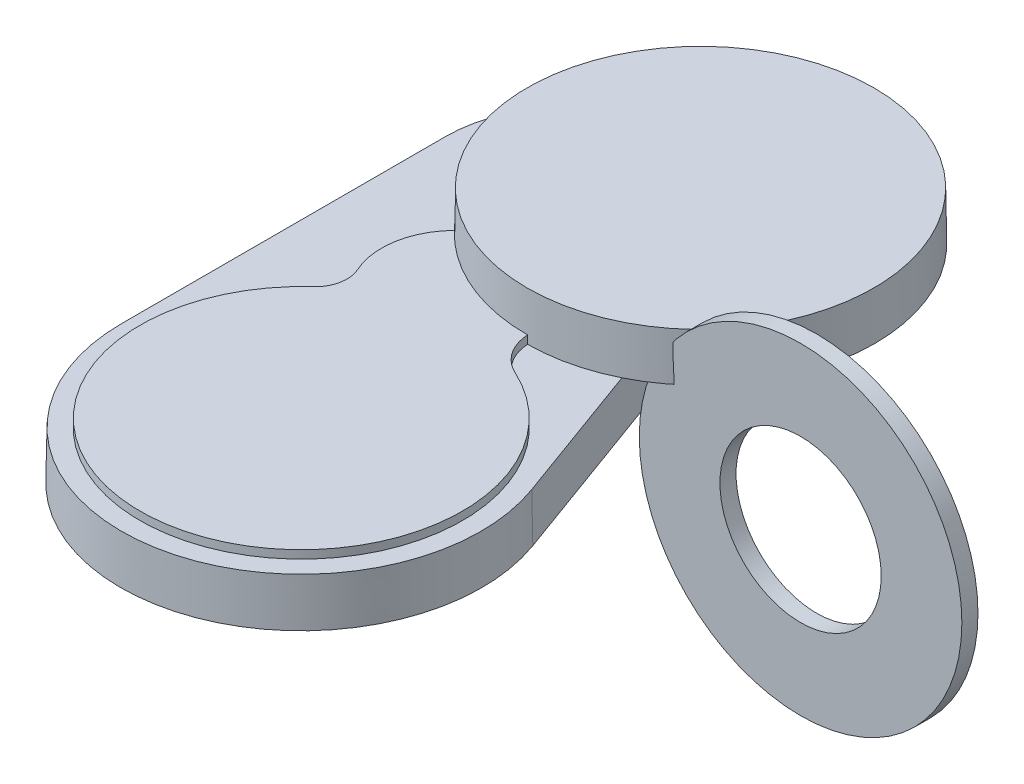
ISO-10303-21;
HEADER;
FILE_DESCRIPTION(('STEP AP214'),'2;1');
FILE_NAME('part.step','',(''),(''),'','','');
FILE_SCHEMA(('AUTOMOTIVE_DESIGN { 1 0 10303 214 1 1 1 1 }'));
ENDSEC;
DATA;
#1=APPLICATION_CONTEXT('core data for automotive mechanical design processes');
#2=APPLICATION_PROTOCOL_DEFINITION('international standard','automotive_design',2000,#1);
#3=PRODUCT_CONTEXT('',#1,'mechanical');
#4=PRODUCT('Part','Part','',(#3));
#5=PRODUCT_RELATED_PRODUCT_CATEGORY('part','',(#4));
#6=PRODUCT_DEFINITION_FORMATION('','',#4);
#7=PRODUCT_DEFINITION_CONTEXT('part definition',#1,'design');
#8=PRODUCT_DEFINITION('design','',#6,#7);
#9=PRODUCT_DEFINITION_SHAPE('','',#8);
#10=(LENGTH_UNIT() NAMED_UNIT(*) SI_UNIT(.MILLI.,.METRE.));
#11=(NAMED_UNIT(*) PLANE_ANGLE_UNIT() SI_UNIT($,.RADIAN.));
#12=(NAMED_UNIT(*) SI_UNIT($,.STERADIAN.) SOLID_ANGLE_UNIT());
#13=UNCERTAINTY_MEASURE_WITH_UNIT(LENGTH_MEASURE(1.E-05),#10,'distance_accuracy_value','');
#14=(GEOMETRIC_REPRESENTATION_CONTEXT(3) GLOBAL_UNCERTAINTY_ASSIGNED_CONTEXT((#13)) GLOBAL_UNIT_ASSIGNED_CONTEXT((#10,
#11,#12)) REPRESENTATION_CONTEXT('',''));
#15=CARTESIAN_POINT('',(0.,0.,0.));
#16=DIRECTION('',(0.,0.,1.));
#17=DIRECTION('',(1.,0.,0.));
#18=AXIS2_PLACEMENT_3D('',#15,#16,#17);
#19=CARTESIAN_POINT('',(-4.04016025250198,15.,-29.7267069339021));
#20=DIRECTION('',(0.,1.,0.));
#21=DIRECTION('',(0.,0.,1.));
#22=AXIS2_PLACEMENT_3D('',#19,#20,#21);
#23=PLANE('',#22);
#24=CARTESIAN_POINT('',(9.67975699595058E-13,15.,-1.59594559789866E-13));
#25=DIRECTION('',(0.,-1.,0.));
#26=DIRECTION('',(0.,0.,-1.));
#27=AXIS2_PLACEMENT_3D('',#24,#25,#26);
#28=CIRCLE('',#27,54.0083349609376);
#29=CARTESIAN_POINT('',(24.0192409310956,15.,48.3733016275182));
#30=VERTEX_POINT('',#29);
#31=CARTESIAN_POINT('',(0.416850091797526,15.,54.0067262593632));
#32=VERTEX_POINT('',#31);
#33=EDGE_CURVE('E155',#30,#32,#28,.T.);
#34=ORIENTED_EDGE('',*,*,#33,.T.);
#35=CARTESIAN_POINT('',(14.3966905600741,15.,53.2556866588508));
#36=DIRECTION('',(0.,-1.,0.));
#37=DIRECTION('',(0.,0.,-1.));
#38=AXIS2_PLACEMENT_3D('',#35,#36,#37);
#39=CIRCLE('',#38,14.);
#40=CARTESIAN_POINT('',(8.5440911187499,15.,65.9736691945917));
#41=VERTEX_POINT('',#40);
#42=EDGE_CURVE('E292',#41,#32,#39,.T.);
#43=ORIENTED_EDGE('',*,*,#42,.F.);
#44=CARTESIAN_POINT('',(-12.3580497431221,15.,111.395035393667));
#45=DIRECTION('',(0.,1.,0.));
#46=DIRECTION('',(0.,0.,1.));
#47=AXIS2_PLACEMENT_3D('',#44,#45,#46);
#48=CIRCLE('',#47,50.);
#49=CARTESIAN_POINT('',(-45.934725953299,15.,74.3463267160766));
#50=VERTEX_POINT('',#49);
#51=EDGE_CURVE('E282',#50,#41,#48,.T.);
#52=ORIENTED_EDGE('',*,*,#51,.F.);
#53=CARTESIAN_POINT('',(-52.6500611953344,15.,66.9365849805586));
#54=DIRECTION('',(0.,-1.,0.));
#55=DIRECTION('',(0.,0.,1.));
#56=AXIS2_PLACEMENT_3D('',#53,#54,#55);
#57=CIRCLE('',#56,10.);
#58=CARTESIAN_POINT('',(-43.5449796893151,15.,62.8016737640094));
#59=VERTEX_POINT('',#58);
#60=EDGE_CURVE('E288',#59,#50,#57,.T.);
#61=ORIENTED_EDGE('',*,*,#60,.F.);
#62=CARTESIAN_POINT('',(-22.6032922254706,15.,53.2913779659463));
#63=DIRECTION('',(0.,1.,0.));
#64=DIRECTION('',(0.,0.,1.));
#65=AXIS2_PLACEMENT_3D('',#62,#63,#64);
#66=CIRCLE('',#65,23.);
#67=CARTESIAN_POINT('',(-39.0963987597677,15.,37.2608621648773));
#68=VERTEX_POINT('',#67);
#69=EDGE_CURVE('E290',#68,#59,#66,.T.);
#70=ORIENTED_EDGE('',*,*,#69,.F.);
#71=CARTESIAN_POINT('',(-49.4166384036446,15.,-21.7921108233274));
#72=VERTEX_POINT('',#71);
#73=EDGE_CURVE('E152',#68,#72,#28,.T.);
#74=ORIENTED_EDGE('',*,*,#73,.T.);
#75=CARTESIAN_POINT('',(-30.070163865149,15.,10.9446445864215));
#76=DIRECTION('',(0.,1.,0.));
#77=DIRECTION('',(0.,0.,1.));
#78=AXIS2_PLACEMENT_3D('',#75,#76,#77);
#79=CIRCLE('',#78,38.0260599040497);
#80=CARTESIAN_POINT('',(-68.0962237691988,15.,10.9446445864215));
#81=VERTEX_POINT('',#80);
#82=EDGE_CURVE('E220',#72,#81,#79,.T.);
#83=ORIENTED_EDGE('',*,*,#82,.T.);
#84=DIRECTION('',(0.,0.,-1.));
#85=VECTOR('',#84,1.);
#86=CARTESIAN_POINT('',(-68.0962237691988,15.,10.9446445864215));
#87=LINE('',#86,#85);
#88=CARTESIAN_POINT('',(-68.0962237691988,15.,111.395035393667));
#89=VERTEX_POINT('',#88);
#90=EDGE_CURVE('E188',#81,#89,#87,.F.);
#91=ORIENTED_EDGE('',*,*,#90,.T.);
#92=CARTESIAN_POINT('',(-12.3580497431221,15.,111.395035393667));
#93=DIRECTION('',(0.,1.,0.));
#94=DIRECTION('',(0.,0.,1.));
#95=AXIS2_PLACEMENT_3D('',#92,#93,#94);
#96=CIRCLE('',#95,55.7381740260767);
#97=CARTESIAN_POINT('',(40.018701085263,15.,92.3314571245568));
#98=VERTEX_POINT('',#97);
#99=EDGE_CURVE('E177',#89,#98,#96,.T.);
#100=ORIENTED_EDGE('',*,*,#99,.T.);
#101=DIRECTION('',(0.342020143325671,0.,0.939692620785908));
#102=VECTOR('',#101,1.);
#103=CARTESIAN_POINT('',(14.2792764513854,15.,21.6129691532245));
#104=LINE('',#103,#102);
#105=EDGE_CURVE('E170',#98,#30,#104,.F.);
#106=ORIENTED_EDGE('',*,*,#105,.T.);
#107=EDGE_LOOP('',(#34,#43,#52,#61,#70,#74,#83,#91,#100,#106));
#108=FACE_BOUND('',#107,.T.);
#109=ADVANCED_FACE('F47',(#108),#23,.T.);
#110=CARTESIAN_POINT('',(-4.04016025250198,0.,-29.7267069339021));
#111=DIRECTION('',(0.,1.,0.));
#112=DIRECTION('',(0.,0.,1.));
#113=AXIS2_PLACEMENT_3D('',#110,#111,#112);
#114=CONICAL_SURFACE('',#113,10.,0.0174532925199433);
#115=CARTESIAN_POINT('',(-4.04016025250198,0.,-29.7267069339021));
#116=DIRECTION('',(0.,-1.,0.));
#117=DIRECTION('',(0.,0.,1.));
#118=AXIS2_PLACEMENT_3D('',#115,#116,#117);
#119=CIRCLE('',#118,10.);
#120=CARTESIAN_POINT('',(-2.69344016833465,0.,-19.8178046226014));
#121=VERTEX_POINT('',#120);
#122=CARTESIAN_POINT('',(-9.43074696785886,0.,-21.304024768213));
#123=VERTEX_POINT('',#122);
#124=EDGE_CURVE('E256',#121,#123,#119,.T.);
#125=ORIENTED_EDGE('',*,*,#124,.T.);
#126=DIRECTION('',(0.00940787102918297,-0.999847695156391,-0.0146996072447666));
#127=VECTOR('',#126,1.);
#128=CARTESIAN_POINT('',(-9.43074696785887,0.,-21.304024768213));
#129=LINE('',#128,#127);
#130=CARTESIAN_POINT('',(-9.57188652953548,15.,-21.0834970721052));
#131=VERTEX_POINT('',#130);
#132=EDGE_CURVE('E56',#131,#123,#129,.T.);
#133=ORIENTED_EDGE('',*,*,#132,.F.);
#134=CARTESIAN_POINT('',(-4.04016025250198,15.,-29.7267069339021));
#135=DIRECTION('',(0.,1.,0.));
#136=DIRECTION('',(0.,0.,1.));
#137=AXIS2_PLACEMENT_3D('',#134,#135,#136);
#138=CIRCLE('',#137,10.2618259739233);
#139=CARTESIAN_POINT('',(-2.65817953857074,15.,-19.5583638227847));
#140=VERTEX_POINT('',#139);
#141=EDGE_CURVE('E218',#140,#131,#138,.F.);
#142=ORIENTED_EDGE('',*,*,#141,.F.);
#143=DIRECTION('',(-0.00235035062661409,-0.999847695156391,-0.0172934190484158));
#144=VECTOR('',#143,1.);
#145=CARTESIAN_POINT('',(-2.69344016833465,0.,-19.8178046226014));
#146=LINE('',#145,#144);
#147=EDGE_CURVE('E191',#140,#121,#146,.T.);
#148=ORIENTED_EDGE('',*,*,#147,.T.);
#149=EDGE_LOOP('',(#125,#133,#142,#148));
#150=FACE_BOUND('',#149,.T.);
#151=ADVANCED_FACE('F331',(#150),#114,.F.);
#152=CARTESIAN_POINT('',(-30.070163865149,0.,10.9446445864215));
#153=DIRECTION('',(0.,-1.,0.));
#154=DIRECTION('',(0.,0.,1.));
#155=AXIS2_PLACEMENT_3D('',#152,#153,#154);
#156=CONICAL_SURFACE('',#155,38.287885877973,0.0174532925199433);
#157=CARTESIAN_POINT('',(-30.070163865149,0.,10.9446445864215));
#158=DIRECTION('',(0.,1.,0.));
#159=DIRECTION('',(0.,0.,1.));
#160=AXIS2_PLACEMENT_3D('',#157,#158,#159);
#161=CIRCLE('',#160,38.287885877973);
#162=CARTESIAN_POINT('',(-68.3580497431221,0.,10.9446445864215));
#163=VERTEX_POINT('',#162);
#164=EDGE_CURVE('E257',#123,#163,#161,.T.);
#165=ORIENTED_EDGE('',*,*,#164,.T.);
#166=DIRECTION('',(-0.0174524064372835,-0.999847695156391,0.));
#167=VECTOR('',#166,1.);
#168=CARTESIAN_POINT('',(-68.3580497431221,0.,10.9446445864215));
#169=LINE('',#168,#167);
#170=EDGE_CURVE('E215',#81,#163,#169,.T.);
#171=ORIENTED_EDGE('',*,*,#170,.F.);
#172=ORIENTED_EDGE('',*,*,#82,.F.);
#173=EDGE_CURVE('E149',#131,#72,#79,.T.);
#174=ORIENTED_EDGE('',*,*,#173,.F.);
#175=ORIENTED_EDGE('',*,*,#132,.T.);
#176=EDGE_LOOP('',(#165,#171,#172,#174,#175));
#177=FACE_BOUND('',#176,.T.);
#178=ADVANCED_FACE('F49',(#177),#156,.T.);
#179=CARTESIAN_POINT('',(-68.3580497431221,0.,10.9446445864215));
#180=DIRECTION('',(-0.999847695156391,0.0174524064372835,0.));
#181=DIRECTION('',(-0.0174524064372835,-0.999847695156391,0.));
#182=AXIS2_PLACEMENT_3D('',#179,#180,#181);
#183=PLANE('',#182);
#184=DIRECTION('',(0.,0.,1.));
#185=VECTOR('',#184,1.);
#186=CARTESIAN_POINT('',(-68.3580497431221,0.,10.9446445864215));
#187=LINE('',#186,#185);
#188=CARTESIAN_POINT('',(-68.3580497431221,0.,111.395035393667));
#189=VERTEX_POINT('',#188);
#190=EDGE_CURVE('E233',#163,#189,#187,.T.);
#191=ORIENTED_EDGE('',*,*,#190,.T.);
#192=DIRECTION('',(-0.0174524064372835,-0.999847695156391,0.));
#193=VECTOR('',#192,1.);
#194=CARTESIAN_POINT('',(-68.3580497431221,0.,111.395035393667));
#195=LINE('',#194,#193);
#196=EDGE_CURVE('E212',#89,#189,#195,.T.);
#197=ORIENTED_EDGE('',*,*,#196,.F.);
#198=ORIENTED_EDGE('',*,*,#90,.F.);
#199=ORIENTED_EDGE('',*,*,#170,.T.);
#200=EDGE_LOOP('',(#191,#197,#198,#199));
#201=FACE_BOUND('',#200,.T.);
#202=ADVANCED_FACE('F231',(#201),#183,.T.);
#203=CARTESIAN_POINT('',(-12.3580497431221,0.,111.395035393667));
#204=DIRECTION('',(0.,-1.,0.));
#205=DIRECTION('',(0.,0.,1.));
#206=AXIS2_PLACEMENT_3D('',#203,#204,#205);
#207=CONICAL_SURFACE('',#206,56.,0.0174532925199433);
#208=CARTESIAN_POINT('',(-12.3580497431221,0.,111.395035393667));
#209=DIRECTION('',(0.,1.,0.));
#210=DIRECTION('',(0.,0.,1.));
#211=AXIS2_PLACEMENT_3D('',#208,#209,#210);
#212=CIRCLE('',#211,56.);
#213=CARTESIAN_POINT('',(40.2647370208888,0.,92.2419073674291));
#214=VERTEX_POINT('',#213);
#215=EDGE_CURVE('E237',#189,#214,#212,.T.);
#216=ORIENTED_EDGE('',*,*,#215,.T.);
#217=DIRECTION('',(0.0163998975440718,-0.999847695156391,-0.00596907455105758));
#218=VECTOR('',#217,1.);
#219=CARTESIAN_POINT('',(40.2647370208888,0.,92.2419073674291));
#220=LINE('',#219,#218);
#221=EDGE_CURVE('E210',#98,#214,#220,.T.);
#222=ORIENTED_EDGE('',*,*,#221,.F.);
#223=ORIENTED_EDGE('',*,*,#99,.F.);
#224=ORIENTED_EDGE('',*,*,#196,.T.);
#225=EDGE_LOOP('',(#216,#222,#223,#224));
#226=FACE_BOUND('',#225,.T.);
#227=ADVANCED_FACE('F236',(#226),#207,.T.);
#228=CARTESIAN_POINT('',(14.5253123870112,0.,21.5234193960969));
#229=DIRECTION('',(0.939549501048259,0.0174524064372835,-0.341968052001231));
#230=DIRECTION('',(-0.342020143325671,0.,-0.939692620785908));
#231=AXIS2_PLACEMENT_3D('',#228,#229,#230);
#232=PLANE('',#231);
#233=DIRECTION('',(-0.342020143325671,0.,-0.939692620785908));
#234=VECTOR('',#233,1.);
#235=CARTESIAN_POINT('',(14.5253123870112,0.,21.5234193960969));
#236=LINE('',#235,#234);
#237=CARTESIAN_POINT('',(14.5253123870112,0.,21.5234193960969));
#238=VERTEX_POINT('',#237);
#239=EDGE_CURVE('E239',#214,#238,#236,.T.);
#240=ORIENTED_EDGE('',*,*,#239,.T.);
#241=DIRECTION('',(0.0163998975440718,-0.999847695156391,-0.00596907455105757));
#242=VECTOR('',#241,1.);
#243=CARTESIAN_POINT('',(14.5253123870112,0.,21.5234193960969));
#244=LINE('',#243,#242);
#245=CARTESIAN_POINT('',(14.2792764513854,15.,21.6129691532245));
#246=VERTEX_POINT('',#245);
#247=EDGE_CURVE('E172',#246,#238,#244,.T.);
#248=ORIENTED_EDGE('',*,*,#247,.F.);
#249=DIRECTION('',(-0.342020143325671,0.,-0.939692620785908));
#250=VECTOR('',#249,1.);
#251=CARTESIAN_POINT('',(14.2792764513854,15.,21.6129691532245));
#252=LINE('',#251,#250);
#253=EDGE_CURVE('E146',#246,#30,#252,.F.);
#254=ORIENTED_EDGE('',*,*,#253,.T.);
#255=ORIENTED_EDGE('',*,*,#105,.F.);
#256=ORIENTED_EDGE('',*,*,#221,.T.);
#257=EDGE_LOOP('',(#240,#248,#254,#255,#256));
#258=FACE_BOUND('',#257,.T.);
#259=ADVANCED_FACE('F168',(#258),#232,.T.);
#260=CARTESIAN_POINT('',(23.9222385948703,0.,18.1032179628402));
#261=DIRECTION('',(0.,1.,0.));
#262=DIRECTION('',(0.,0.,-1.));
#263=AXIS2_PLACEMENT_3D('',#260,#261,#262);
#264=CONICAL_SURFACE('',#263,10.,0.0174532925199433);
#265=CARTESIAN_POINT('',(23.9222385948703,0.,18.1032179628402));
#266=DIRECTION('',(0.,-1.,0.));
#267=DIRECTION('',(0.,0.,-1.));
#268=AXIS2_PLACEMENT_3D('',#265,#266,#267);
#269=CIRCLE('',#268,10.);
#270=CARTESIAN_POINT('',(15.9481590632469,0.,12.0688119752268));
#271=VERTEX_POINT('',#270);
#272=EDGE_CURVE('E244',#238,#271,#269,.T.);
#273=ORIENTED_EDGE('',*,*,#272,.T.);
#274=DIRECTION('',(0.0139166876949116,-0.999847695156391,0.0105314905903406));
#275=VECTOR('',#274,1.);
#276=CARTESIAN_POINT('',(15.9481590632469,0.,12.0688119752268));
#277=LINE('',#276,#275);
#278=CARTESIAN_POINT('',(15.739376949296,15.,11.9108155527513));
#279=VERTEX_POINT('',#278);
#280=EDGE_CURVE('E196',#279,#271,#277,.T.);
#281=ORIENTED_EDGE('',*,*,#280,.F.);
#282=CARTESIAN_POINT('',(23.9222385948703,15.,18.1032179628402));
#283=DIRECTION('',(0.,1.,0.));
#284=DIRECTION('',(0.,0.,1.));
#285=AXIS2_PLACEMENT_3D('',#282,#283,#284);
#286=CIRCLE('',#285,10.2618259739233);
#287=EDGE_CURVE('E180',#246,#279,#286,.F.);
#288=ORIENTED_EDGE('',*,*,#287,.F.);
#289=ORIENTED_EDGE('',*,*,#247,.T.);
#290=EDGE_LOOP('',(#273,#281,#288,#289));
#291=FACE_BOUND('',#290,.T.);
#292=ADVANCED_FACE('F346',(#291),#264,.F.);
#293=CARTESIAN_POINT('',(0.,0.,0.));
#294=DIRECTION('',(0.,-1.,0.));
#295=DIRECTION('',(0.,0.,1.));
#296=AXIS2_PLACEMENT_3D('',#293,#294,#295);
#297=CONICAL_SURFACE('',#296,20.,0.0174532925199433);
#298=CARTESIAN_POINT('',(0.,0.,0.));
#299=DIRECTION('',(0.,1.,0.));
#300=DIRECTION('',(0.,0.,1.));
#301=AXIS2_PLACEMENT_3D('',#298,#299,#300);
#302=CIRCLE('',#301,20.);
#303=EDGE_CURVE('E221',#271,#121,#302,.T.);
#304=ORIENTED_EDGE('',*,*,#303,.T.);
#305=ORIENTED_EDGE('',*,*,#147,.F.);
#306=CARTESIAN_POINT('',(0.,15.,0.));
#307=DIRECTION('',(0.,1.,0.));
#308=DIRECTION('',(0.,0.,1.));
#309=AXIS2_PLACEMENT_3D('',#306,#307,#308);
#310=CIRCLE('',#309,19.7381740260767);
#311=EDGE_CURVE('E185',#279,#140,#310,.T.);
#312=ORIENTED_EDGE('',*,*,#311,.F.);
#313=ORIENTED_EDGE('',*,*,#280,.T.);
#314=EDGE_LOOP('',(#304,#305,#312,#313));
#315=FACE_BOUND('',#314,.T.);
#316=ADVANCED_FACE('F254',(#315),#297,.T.);
#317=CARTESIAN_POINT('',(-4.04016025250198,0.,-29.7267069339021));
#318=DIRECTION('',(0.,1.,0.));
#319=DIRECTION('',(0.,0.,1.));
#320=AXIS2_PLACEMENT_3D('',#317,#318,#319);
#321=PLANE('',#320);
#322=CARTESIAN_POINT('',(9.69710423071035E-13,0.,3.21791204793698E-13));
#323=DIRECTION('',(0.,-1.,0.));
#324=DIRECTION('',(0.,0.,-1.));
#325=AXIS2_PLACEMENT_3D('',#322,#323,#324);
#326=CIRCLE('',#325,5.00000000000011);
#327=CARTESIAN_POINT('',(9.69710423071035E-13,0.,-4.99999999999979));
#328=VERTEX_POINT('',#327);
#329=EDGE_CURVE('E294',#328,#328,#326,.T.);
#330=ORIENTED_EDGE('',*,*,#329,.F.);
#331=EDGE_LOOP('',(#330));
#332=FACE_BOUND('',#331,.T.);
#333=ORIENTED_EDGE('',*,*,#124,.F.);
#334=ORIENTED_EDGE('',*,*,#303,.F.);
#335=ORIENTED_EDGE('',*,*,#272,.F.);
#336=ORIENTED_EDGE('',*,*,#239,.F.);
#337=ORIENTED_EDGE('',*,*,#215,.F.);
#338=ORIENTED_EDGE('',*,*,#190,.F.);
#339=ORIENTED_EDGE('',*,*,#164,.F.);
#340=EDGE_LOOP('',(#333,#334,#335,#336,#337,#338,#339));
#341=FACE_BOUND('',#340,.T.);
#342=ADVANCED_FACE('F242',(#332,#341),#321,.F.);
#343=CARTESIAN_POINT('',(14.3966905600741,15.,53.2556866588508));
#344=DIRECTION('',(0.,1.,0.));
#345=DIRECTION('',(0.,0.,-1.));
#346=AXIS2_PLACEMENT_3D('',#343,#344,#345);
#347=CONICAL_SURFACE('',#346,14.,0.0174532925199433);
#348=ORIENTED_EDGE('',*,*,#42,.T.);
#349=CARTESIAN_POINT('',(0.421457103444091,14.7498,54.0110578939167));
#350=CARTESIAN_POINT('',(0.412247773865086,15.2498664256724,54.0024007914562));
#351=CARTESIAN_POINT('',(0.403047244080627,15.7499329718421,53.9937413074458));
#352=CARTESIAN_POINT('',(0.384663784100813,16.7500663051754,53.9764175763255));
#353=CARTESIAN_POINT('',(0.375480853905459,17.2501330923391,53.9677533292156));
#354=CARTESIAN_POINT('',(0.366306723504651,17.7502,53.9590867005558));
#355=B_SPLINE_CURVE_WITH_KNOTS('',3,(#349,#350,#351,#352,#353,#354),.UNSPECIFIED.,.F.,.F.,(4,2,
4),(0.,1.50067840761684,3.00135681523194),.UNSPECIFIED.);
#356=CARTESIAN_POINT('',(0.370897588321761,17.5,53.9634227001062));
#357=VERTEX_POINT('',#356);
#358=EDGE_CURVE('E159',#32,#357,#355,.T.);
#359=ORIENTED_EDGE('',*,*,#358,.T.);
#360=CARTESIAN_POINT('',(14.3966905600741,17.5,53.2556866588508));
#361=DIRECTION('',(0.,-1.,0.));
#362=DIRECTION('',(0.,0.,-1.));
#363=AXIS2_PLACEMENT_3D('',#360,#361,#362);
#364=CIRCLE('',#363,14.0436376623205);
#365=CARTESIAN_POINT('',(8.52584870745576,17.5,66.0133108393984));
#366=VERTEX_POINT('',#365);
#367=EDGE_CURVE('E280',#366,#357,#364,.T.);
#368=ORIENTED_EDGE('',*,*,#367,.F.);
#369=DIRECTION('',(0.00729585315461485,-0.999847695156391,-0.015854242876859));
#370=VECTOR('',#369,1.);
#371=CARTESIAN_POINT('',(8.5440911187499,15.,65.9736691945918));
#372=LINE('',#371,#370);
#373=EDGE_CURVE('E275',#366,#41,#372,.T.);
#374=ORIENTED_EDGE('',*,*,#373,.T.);
#375=EDGE_LOOP('',(#348,#359,#368,#374));
#376=FACE_BOUND('',#375,.T.);
#377=ADVANCED_FACE('F307',(#376),#347,.F.);
#378=CARTESIAN_POINT('',(-22.6032922254706,15.,53.2913779659463));
#379=DIRECTION('',(0.,-1.,0.));
#380=DIRECTION('',(0.,0.,1.));
#381=AXIS2_PLACEMENT_3D('',#378,#379,#380);
#382=CONICAL_SURFACE('',#381,23.,0.0174532925199433);
#383=CARTESIAN_POINT('',(-22.6032922254706,17.5,53.2913779659463));
#384=DIRECTION('',(0.,-1.,0.));
#385=DIRECTION('',(0.,0.,-1.));
#386=AXIS2_PLACEMENT_3D('',#383,#384,#385);
#387=CIRCLE('',#386,22.9563623376794);
#388=CARTESIAN_POINT('',(-39.0357959120728,17.5,37.2611753980237));
#389=VERTEX_POINT('',#388);
#390=CARTESIAN_POINT('',(-43.505247242099,17.5,62.7836299780701));
#391=VERTEX_POINT('',#390);
#392=EDGE_CURVE('E278',#389,#391,#387,.F.);
#393=ORIENTED_EDGE('',*,*,#392,.F.);
#394=CARTESIAN_POINT('',(-39.0297265873327,17.7502,37.2612085243054));
#395=CARTESIAN_POINT('',(-39.0418578955297,17.2501335549071,37.2611419977727));
#396=CARTESIAN_POINT('',(-39.0539846435285,16.7500669990273,37.2610774065517));
#397=CARTESIAN_POINT('',(-39.0782290191298,15.7499336656939,37.2609520947332));
#398=CARTESIAN_POINT('',(-39.0903466467324,15.2498668882404,37.2608913741357));
#399=CARTESIAN_POINT('',(-39.1024597141368,14.7498,37.2608325888499));
#400=B_SPLINE_CURVE_WITH_KNOTS('',3,(#394,#395,#396,#397,#398,#399),.UNSPECIFIED.,.F.,.F.,(4,2,
4),(0.,1.50064073065041,3.0012814613005),.UNSPECIFIED.);
#401=EDGE_CURVE('E63',#389,#68,#400,.T.);
#402=ORIENTED_EDGE('',*,*,#401,.T.);
#403=ORIENTED_EDGE('',*,*,#69,.T.);
#404=DIRECTION('',(-0.0158905583087644,-0.999847695156391,0.00721641511332988));
#405=VECTOR('',#404,1.);
#406=CARTESIAN_POINT('',(-43.5449796893151,15.,62.8016737640094));
#407=LINE('',#406,#405);
#408=EDGE_CURVE('E260',#391,#59,#407,.T.);
#409=ORIENTED_EDGE('',*,*,#408,.F.);
#410=EDGE_LOOP('',(#393,#402,#403,#409));
#411=FACE_BOUND('',#410,.T.);
#412=ADVANCED_FACE('F338',(#411),#382,.T.);
#413=CARTESIAN_POINT('',(-52.6500611953344,15.,66.9365849805586));
#414=DIRECTION('',(0.,1.,0.));
#415=DIRECTION('',(0.,0.,1.));
#416=AXIS2_PLACEMENT_3D('',#413,#414,#415);
#417=CONICAL_SURFACE('',#416,10.,0.0174532925199433);
#418=ORIENTED_EDGE('',*,*,#60,.T.);
#419=DIRECTION('',(-0.0117198760006616,-0.999847695156391,-0.0129317824363563));
#420=VECTOR('',#419,1.);
#421=CARTESIAN_POINT('',(-45.934725953299,15.,74.3463267160766));
#422=LINE('',#421,#420);
#423=CARTESIAN_POINT('',(-45.9054218001329,17.5,74.3786610968503));
#424=VERTEX_POINT('',#423);
#425=EDGE_CURVE('E70',#424,#50,#422,.T.);
#426=ORIENTED_EDGE('',*,*,#425,.F.);
#427=CARTESIAN_POINT('',(-52.6500611953344,17.5,66.9365849805586));
#428=DIRECTION('',(0.,-1.,0.));
#429=DIRECTION('',(0.,0.,-1.));
#430=AXIS2_PLACEMENT_3D('',#427,#428,#429);
#431=CIRCLE('',#430,10.0436376623205);
#432=EDGE_CURVE('E276',#391,#424,#431,.T.);
#433=ORIENTED_EDGE('',*,*,#432,.F.);
#434=ORIENTED_EDGE('',*,*,#408,.T.);
#435=EDGE_LOOP('',(#418,#426,#433,#434));
#436=FACE_BOUND('',#435,.T.);
#437=ADVANCED_FACE('F329',(#436),#417,.F.);
#438=CARTESIAN_POINT('',(-12.3580497431221,15.,111.395035393667));
#439=DIRECTION('',(0.,-1.,0.));
#440=DIRECTION('',(0.,0.,1.));
#441=AXIS2_PLACEMENT_3D('',#438,#439,#440);
#442=CONICAL_SURFACE('',#441,50.,0.0174532925199433);
#443=ORIENTED_EDGE('',*,*,#51,.T.);
#444=ORIENTED_EDGE('',*,*,#373,.F.);
#445=CARTESIAN_POINT('',(-12.3580497431221,17.5,111.395035393667));
#446=DIRECTION('',(0.,-1.,0.));
#447=DIRECTION('',(0.,0.,-1.));
#448=AXIS2_PLACEMENT_3D('',#445,#446,#447);
#449=CIRCLE('',#448,49.9563623376795);
#450=EDGE_CURVE('E267',#424,#366,#449,.F.);
#451=ORIENTED_EDGE('',*,*,#450,.F.);
#452=ORIENTED_EDGE('',*,*,#425,.T.);
#453=EDGE_LOOP('',(#443,#444,#451,#452));
#454=FACE_BOUND('',#453,.T.);
#455=ADVANCED_FACE('F324',(#454),#442,.T.);
#456=CARTESIAN_POINT('',(-4.10330083269825,17.5,53.2735323123986));
#457=DIRECTION('',(0.,-1.,0.));
#458=DIRECTION('',(0.,0.,-1.));
#459=AXIS2_PLACEMENT_3D('',#456,#457,#458);
#460=PLANE('',#459);
#461=ORIENTED_EDGE('',*,*,#367,.T.);
#462=CARTESIAN_POINT('',(9.67975699595058E-13,17.5,-1.59594559789866E-13));
#463=DIRECTION('',(0.,-1.,0.));
#464=DIRECTION('',(0.,0.,-1.));
#465=AXIS2_PLACEMENT_3D('',#462,#463,#464);
#466=CIRCLE('',#465,53.9646972986171);
#467=EDGE_CURVE('E12',#357,#389,#466,.T.);
#468=ORIENTED_EDGE('',*,*,#467,.T.);
#469=ORIENTED_EDGE('',*,*,#392,.T.);
#470=ORIENTED_EDGE('',*,*,#432,.T.);
#471=ORIENTED_EDGE('',*,*,#450,.T.);
#472=EDGE_LOOP('',(#461,#468,#469,#470,#471));
#473=FACE_BOUND('',#472,.T.);
#474=ADVANCED_FACE('F321',(#473),#460,.F.);
#475=CARTESIAN_POINT('',(9.69710423071035E-13,45.6220356855061,3.21791204793698E-13));
#476=DIRECTION('',(0.,-1.,0.));
#477=DIRECTION('',(0.,0.,-1.));
#478=AXIS2_PLACEMENT_3D('',#475,#476,#477);
#479=CYLINDRICAL_SURFACE('',#478,5.00000000000011);
#480=CARTESIAN_POINT('',(9.69710423071035E-13,15.,3.21791204793698E-13));
#481=DIRECTION('',(0.,-1.,0.));
#482=DIRECTION('',(0.,0.,-1.));
#483=AXIS2_PLACEMENT_3D('',#480,#481,#482);
#484=CIRCLE('',#483,5.00000000000011);
#485=CARTESIAN_POINT('',(9.69710423071035E-13,15.,-4.99999999999979));
#486=VERTEX_POINT('',#485);
#487=EDGE_CURVE('E165',#486,#486,#484,.F.);
#488=ORIENTED_EDGE('',*,*,#487,.T.);
#489=EDGE_LOOP('',(#488));
#490=FACE_BOUND('',#489,.T.);
#491=ORIENTED_EDGE('',*,*,#329,.T.);
#492=EDGE_LOOP('',(#491));
#493=FACE_BOUND('',#492,.T.);
#494=ADVANCED_FACE('F318',(#490,#493),#479,.F.);
#495=CARTESIAN_POINT('',(-54.0083349609367,15.,-1.59594559789866E-13));
#496=DIRECTION('',(0.,-1.,0.));
#497=DIRECTION('',(0.,0.,-1.));
#498=AXIS2_PLACEMENT_3D('',#495,#496,#497);
#499=PLANE('',#498);
#500=ORIENTED_EDGE('',*,*,#487,.F.);
#501=EDGE_LOOP('',(#500));
#502=FACE_BOUND('',#501,.T.);
#503=ADVANCED_FACE('F315',(#502),#499,.T.);
#504=CARTESIAN_POINT('',(9.67975699595058E-13,15.,-1.59594559789866E-13));
#505=DIRECTION('',(0.,-1.,0.));
#506=DIRECTION('',(0.,0.,-1.));
#507=AXIS2_PLACEMENT_3D('',#504,#505,#506);
#508=CONICAL_SURFACE('',#507,54.0083349609376,0.0174532925199442);
#509=CARTESIAN_POINT('',(9.67975699595058E-13,29.8,-1.59594559789866E-13));
#510=DIRECTION('',(0.,-1.,0.));
#511=DIRECTION('',(0.,0.,-1.));
#512=AXIS2_PLACEMENT_3D('',#509,#510,#511);
#513=CIRCLE('',#512,53.75);
#514=CARTESIAN_POINT('',(9.67975699595058E-13,29.8,-53.7500000000002));
#515=VERTEX_POINT('',#514);
#516=EDGE_CURVE('E153',#515,#515,#513,.T.);
#517=ORIENTED_EDGE('',*,*,#516,.T.);
#518=EDGE_LOOP('',(#517));
#519=FACE_BOUND('',#518,.T.);
#520=ORIENTED_EDGE('',*,*,#358,.F.);
#521=ORIENTED_EDGE('',*,*,#33,.F.);
#522=EDGE_CURVE('E142',#72,#30,#28,.T.);
#523=ORIENTED_EDGE('',*,*,#522,.F.);
#524=ORIENTED_EDGE('',*,*,#73,.F.);
#525=ORIENTED_EDGE('',*,*,#401,.F.);
#526=ORIENTED_EDGE('',*,*,#467,.F.);
#527=EDGE_LOOP('',(#520,#521,#523,#524,#525,#526));
#528=FACE_BOUND('',#527,.T.);
#529=ADVANCED_FACE('F157',(#519,#528),#508,.T.);
#530=ORIENTED_EDGE('',*,*,#173,.T.);
#531=ORIENTED_EDGE('',*,*,#522,.T.);
#532=ORIENTED_EDGE('',*,*,#253,.F.);
#533=ORIENTED_EDGE('',*,*,#287,.T.);
#534=ORIENTED_EDGE('',*,*,#311,.T.);
#535=ORIENTED_EDGE('',*,*,#141,.T.);
#536=EDGE_LOOP('',(#530,#531,#532,#533,#534,#535));
#537=FACE_BOUND('',#536,.T.);
#538=ADVANCED_FACE('F144',(#537),#499,.T.);
#539=CARTESIAN_POINT('',(9.67975699595058E-13,29.8,-1.59594559789866E-13));
#540=DIRECTION('',(0.,1.,0.));
#541=DIRECTION('',(0.,0.,1.));
#542=AXIS2_PLACEMENT_3D('',#539,#540,#541);
#543=PLANE('',#542);
#544=ORIENTED_EDGE('',*,*,#516,.F.);
#545=EDGE_LOOP('',(#544));
#546=FACE_BOUND('',#545,.T.);
#547=ADVANCED_FACE('F463',(#546),#543,.T.);
#548=CLOSED_SHELL('',(#109,#151,#178,#202,#227,#259,#292,#316,#342,#377,#412,#437,#455,#474,
#494,#503,#529,#538,#547));
#549=MANIFOLD_SOLID_BREP('B2',#548);
#550=CARTESIAN_POINT('',(73.0385363536992,-4.3779643144939,37.0201393808798));
#551=DIRECTION('',(0.,0.,1.));
#552=DIRECTION('',(1.,0.,0.));
#553=AXIS2_PLACEMENT_3D('',#550,#551,#552);
#554=CYLINDRICAL_SURFACE('',#553,50.);
#555=CARTESIAN_POINT('',(73.0385363536992,-4.3779643144939,37.0201393808798));
#556=DIRECTION('',(0.,0.,1.));
#557=DIRECTION('',(1.,0.,0.));
#558=AXIS2_PLACEMENT_3D('',#555,#556,#557);
#559=CIRCLE('',#558,50.);
#560=CARTESIAN_POINT('',(123.038536353699,-4.3779643144939,37.0201393808798));
#561=VERTEX_POINT('',#560);
#562=EDGE_CURVE('E46',#561,#561,#559,.T.);
#563=ORIENTED_EDGE('',*,*,#562,.T.);
#564=EDGE_LOOP('',(#563));
#565=FACE_BOUND('',#564,.T.);
#566=CARTESIAN_POINT('',(73.0385363536992,-4.3779643144939,42.0201393808798));
#567=DIRECTION('',(0.,0.,1.));
#568=DIRECTION('',(1.,0.,0.));
#569=AXIS2_PLACEMENT_3D('',#566,#567,#568);
#570=CIRCLE('',#569,50.);
#571=CARTESIAN_POINT('',(123.038536353699,-4.3779643144939,42.0201393808798));
#572=VERTEX_POINT('',#571);
#573=EDGE_CURVE('E505',#572,#572,#570,.T.);
#574=ORIENTED_EDGE('',*,*,#573,.F.);
#575=EDGE_LOOP('',(#574));
#576=FACE_BOUND('',#575,.T.);
#577=ADVANCED_FACE('F502',(#565,#576),#554,.T.);
#578=CARTESIAN_POINT('',(73.0385363536992,-4.3779643144939,37.0201393808798));
#579=DIRECTION('',(0.,0.,1.));
#580=DIRECTION('',(1.,0.,0.));
#581=AXIS2_PLACEMENT_3D('',#578,#579,#580);
#582=PLANE('',#581);
#583=CARTESIAN_POINT('',(73.0385363536992,-4.3779643144939,37.0201393808798));
#584=DIRECTION('',(0.,0.,1.));
#585=DIRECTION('',(1.,0.,0.));
#586=AXIS2_PLACEMENT_3D('',#583,#584,#585);
#587=CIRCLE('',#586,25.);
#588=CARTESIAN_POINT('',(98.0385363536992,-4.3779643144939,37.0201393808798));
#589=VERTEX_POINT('',#588);
#590=EDGE_CURVE('E516',#589,#589,#587,.T.);
#591=ORIENTED_EDGE('',*,*,#590,.T.);
#592=EDGE_LOOP('',(#591));
#593=FACE_BOUND('',#592,.T.);
#594=ORIENTED_EDGE('',*,*,#562,.F.);
#595=EDGE_LOOP('',(#594));
#596=FACE_BOUND('',#595,.T.);
#597=ADVANCED_FACE('F527',(#593,#596),#582,.F.);
#598=CARTESIAN_POINT('',(73.0385363536992,-4.3779643144939,42.0201393808798));
#599=DIRECTION('',(0.,0.,1.));
#600=DIRECTION('',(1.,0.,0.));
#601=AXIS2_PLACEMENT_3D('',#598,#599,#600);
#602=PLANE('',#601);
#603=CARTESIAN_POINT('',(73.0385363536992,-4.3779643144939,42.0201393808798));
#604=DIRECTION('',(0.,0.,1.));
#605=DIRECTION('',(1.,0.,0.));
#606=AXIS2_PLACEMENT_3D('',#603,#604,#605);
#607=CIRCLE('',#606,25.);
#608=CARTESIAN_POINT('',(98.0385363536992,-4.3779643144939,42.0201393808798));
#609=VERTEX_POINT('',#608);
#610=EDGE_CURVE('E518',#609,#609,#607,.T.);
#611=ORIENTED_EDGE('',*,*,#610,.F.);
#612=EDGE_LOOP('',(#611));
#613=FACE_BOUND('',#612,.T.);
#614=ORIENTED_EDGE('',*,*,#573,.T.);
#615=EDGE_LOOP('',(#614));
#616=FACE_BOUND('',#615,.T.);
#617=ADVANCED_FACE('F533',(#613,#616),#602,.T.);
#618=CARTESIAN_POINT('',(73.0385363536992,-4.3779643144939,37.0201393808798));
#619=DIRECTION('',(0.,0.,1.));
#620=DIRECTION('',(1.,0.,0.));
#621=AXIS2_PLACEMENT_3D('',#618,#619,#620);
#622=CYLINDRICAL_SURFACE('',#621,25.);
#623=ORIENTED_EDGE('',*,*,#590,.F.);
#624=EDGE_LOOP('',(#623));
#625=FACE_BOUND('',#624,.T.);
#626=ORIENTED_EDGE('',*,*,#610,.T.);
#627=EDGE_LOOP('',(#626));
#628=FACE_BOUND('',#627,.T.);
#629=ADVANCED_FACE('F530',(#625,#628),#622,.F.);
#630=CLOSED_SHELL('',(#577,#597,#617,#629));
#631=MANIFOLD_SOLID_BREP('B6',#630);
#632=ADVANCED_BREP_SHAPE_REPRESENTATION('',(#18,#549,#631),#14);
#633=SHAPE_DEFINITION_REPRESENTATION(#9,#632);
ENDSEC;
END-ISO-10303-21;
